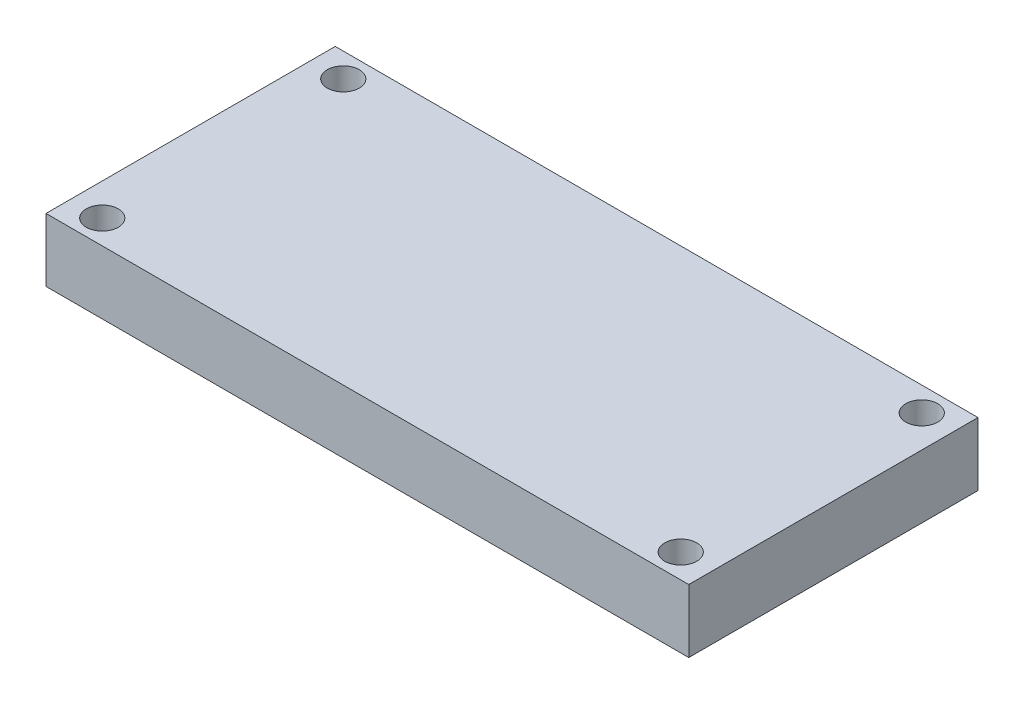
ISO-10303-21;
HEADER;
FILE_DESCRIPTION(('STEP AP214'),'2;1');
FILE_NAME('part.step','',(''),(''),'','','');
FILE_SCHEMA(('AUTOMOTIVE_DESIGN { 1 0 10303 214 1 1 1 1 }'));
ENDSEC;
DATA;
#1=APPLICATION_CONTEXT('core data for automotive mechanical design processes');
#2=APPLICATION_PROTOCOL_DEFINITION('international standard','automotive_design',2000,#1);
#3=PRODUCT_CONTEXT('',#1,'mechanical');
#4=PRODUCT('Part','Part','',(#3));
#5=PRODUCT_RELATED_PRODUCT_CATEGORY('part','',(#4));
#6=PRODUCT_DEFINITION_FORMATION('','',#4);
#7=PRODUCT_DEFINITION_CONTEXT('part definition',#1,'design');
#8=PRODUCT_DEFINITION('design','',#6,#7);
#9=PRODUCT_DEFINITION_SHAPE('','',#8);
#10=(LENGTH_UNIT() NAMED_UNIT(*) SI_UNIT(.MILLI.,.METRE.));
#11=(NAMED_UNIT(*) PLANE_ANGLE_UNIT() SI_UNIT($,.RADIAN.));
#12=(NAMED_UNIT(*) SI_UNIT($,.STERADIAN.) SOLID_ANGLE_UNIT());
#13=UNCERTAINTY_MEASURE_WITH_UNIT(LENGTH_MEASURE(1.E-05),#10,'distance_accuracy_value','');
#14=(GEOMETRIC_REPRESENTATION_CONTEXT(3) GLOBAL_UNCERTAINTY_ASSIGNED_CONTEXT((#13)) GLOBAL_UNIT_ASSIGNED_CONTEXT((#10,
#11,#12)) REPRESENTATION_CONTEXT('',''));
#15=CARTESIAN_POINT('',(0.,0.,0.));
#16=DIRECTION('',(0.,0.,1.));
#17=DIRECTION('',(1.,0.,0.));
#18=AXIS2_PLACEMENT_3D('',#15,#16,#17);
#19=CARTESIAN_POINT('',(25.4,5.,11.43));
#20=DIRECTION('',(-1.,0.,0.));
#21=DIRECTION('',(0.,0.,1.));
#22=AXIS2_PLACEMENT_3D('',#19,#20,#21);
#23=PLANE('',#22);
#24=DIRECTION('',(0.,0.,-1.));
#25=VECTOR('',#24,1.);
#26=CARTESIAN_POINT('',(25.4,0.,11.43));
#27=LINE('',#26,#25);
#28=CARTESIAN_POINT('',(25.4,0.,11.43));
#29=VERTEX_POINT('',#28);
#30=CARTESIAN_POINT('',(25.4,0.,-11.43));
#31=VERTEX_POINT('',#30);
#32=EDGE_CURVE('E96',#29,#31,#27,.T.);
#33=ORIENTED_EDGE('',*,*,#32,.T.);
#34=DIRECTION('',(0.,-1.,0.));
#35=VECTOR('',#34,1.);
#36=CARTESIAN_POINT('',(25.4,5.,-11.43));
#37=LINE('',#36,#35);
#38=CARTESIAN_POINT('',(25.4,5.,-11.43));
#39=VERTEX_POINT('',#38);
#40=EDGE_CURVE('E11',#39,#31,#37,.T.);
#41=ORIENTED_EDGE('',*,*,#40,.F.);
#42=DIRECTION('',(0.,0.,-1.));
#43=VECTOR('',#42,1.);
#44=CARTESIAN_POINT('',(25.4,5.,11.43));
#45=LINE('',#44,#43);
#46=CARTESIAN_POINT('',(25.4,5.,11.43));
#47=VERTEX_POINT('',#46);
#48=EDGE_CURVE('E84',#47,#39,#45,.T.);
#49=ORIENTED_EDGE('',*,*,#48,.F.);
#50=DIRECTION('',(0.,-1.,0.));
#51=VECTOR('',#50,1.);
#52=CARTESIAN_POINT('',(25.4,5.,11.43));
#53=LINE('',#52,#51);
#54=EDGE_CURVE('E92',#47,#29,#53,.T.);
#55=ORIENTED_EDGE('',*,*,#54,.T.);
#56=EDGE_LOOP('',(#33,#41,#49,#55));
#57=FACE_BOUND('',#56,.T.);
#58=ADVANCED_FACE('F33',(#57),#23,.F.);
#59=CARTESIAN_POINT('',(-25.4,5.,-11.43));
#60=DIRECTION('',(0.,0.,1.));
#61=DIRECTION('',(1.,0.,0.));
#62=AXIS2_PLACEMENT_3D('',#59,#60,#61);
#63=PLANE('',#62);
#64=DIRECTION('',(-1.,0.,0.));
#65=VECTOR('',#64,1.);
#66=CARTESIAN_POINT('',(-25.4,0.,-11.43));
#67=LINE('',#66,#65);
#68=CARTESIAN_POINT('',(-25.4,0.,-11.43));
#69=VERTEX_POINT('',#68);
#70=EDGE_CURVE('E88',#31,#69,#67,.T.);
#71=ORIENTED_EDGE('',*,*,#70,.T.);
#72=DIRECTION('',(0.,-1.,0.));
#73=VECTOR('',#72,1.);
#74=CARTESIAN_POINT('',(-25.4,5.,-11.43));
#75=LINE('',#74,#73);
#76=CARTESIAN_POINT('',(-25.4,5.,-11.43));
#77=VERTEX_POINT('',#76);
#78=EDGE_CURVE('E41',#77,#69,#75,.T.);
#79=ORIENTED_EDGE('',*,*,#78,.F.);
#80=DIRECTION('',(-1.,0.,0.));
#81=VECTOR('',#80,1.);
#82=CARTESIAN_POINT('',(-25.4,5.,-11.43));
#83=LINE('',#82,#81);
#84=EDGE_CURVE('E79',#39,#77,#83,.T.);
#85=ORIENTED_EDGE('',*,*,#84,.F.);
#86=ORIENTED_EDGE('',*,*,#40,.T.);
#87=EDGE_LOOP('',(#71,#79,#85,#86));
#88=FACE_BOUND('',#87,.T.);
#89=ADVANCED_FACE('F87',(#88),#63,.F.);
#90=CARTESIAN_POINT('',(-25.4,5.,11.43));
#91=DIRECTION('',(1.,0.,0.));
#92=DIRECTION('',(0.,0.,-1.));
#93=AXIS2_PLACEMENT_3D('',#90,#91,#92);
#94=PLANE('',#93);
#95=DIRECTION('',(0.,0.,1.));
#96=VECTOR('',#95,1.);
#97=CARTESIAN_POINT('',(-25.4,0.,11.43));
#98=LINE('',#97,#96);
#99=CARTESIAN_POINT('',(-25.4,0.,11.43));
#100=VERTEX_POINT('',#99);
#101=EDGE_CURVE('E66',#69,#100,#98,.T.);
#102=ORIENTED_EDGE('',*,*,#101,.T.);
#103=DIRECTION('',(0.,-1.,0.));
#104=VECTOR('',#103,1.);
#105=CARTESIAN_POINT('',(-25.4,5.,11.43));
#106=LINE('',#105,#104);
#107=CARTESIAN_POINT('',(-25.4,5.,11.43));
#108=VERTEX_POINT('',#107);
#109=EDGE_CURVE('E89',#108,#100,#106,.T.);
#110=ORIENTED_EDGE('',*,*,#109,.F.);
#111=DIRECTION('',(0.,0.,1.));
#112=VECTOR('',#111,1.);
#113=CARTESIAN_POINT('',(-25.4,5.,11.43));
#114=LINE('',#113,#112);
#115=EDGE_CURVE('E82',#77,#108,#114,.T.);
#116=ORIENTED_EDGE('',*,*,#115,.F.);
#117=ORIENTED_EDGE('',*,*,#78,.T.);
#118=EDGE_LOOP('',(#102,#110,#116,#117));
#119=FACE_BOUND('',#118,.T.);
#120=ADVANCED_FACE('F90',(#119),#94,.F.);
#121=CARTESIAN_POINT('',(-25.4,5.,11.43));
#122=DIRECTION('',(0.,0.,-1.));
#123=DIRECTION('',(-1.,0.,0.));
#124=AXIS2_PLACEMENT_3D('',#121,#122,#123);
#125=PLANE('',#124);
#126=DIRECTION('',(1.,0.,0.));
#127=VECTOR('',#126,1.);
#128=CARTESIAN_POINT('',(-25.4,0.,11.43));
#129=LINE('',#128,#127);
#130=EDGE_CURVE('E72',#100,#29,#129,.T.);
#131=ORIENTED_EDGE('',*,*,#130,.T.);
#132=ORIENTED_EDGE('',*,*,#54,.F.);
#133=DIRECTION('',(1.,0.,0.));
#134=VECTOR('',#133,1.);
#135=CARTESIAN_POINT('',(-25.4,5.,11.43));
#136=LINE('',#135,#134);
#137=EDGE_CURVE('E49',#108,#47,#136,.T.);
#138=ORIENTED_EDGE('',*,*,#137,.F.);
#139=ORIENTED_EDGE('',*,*,#109,.T.);
#140=EDGE_LOOP('',(#131,#132,#138,#139));
#141=FACE_BOUND('',#140,.T.);
#142=ADVANCED_FACE('F104',(#141),#125,.F.);
#143=CARTESIAN_POINT('',(0.,5.,0.));
#144=DIRECTION('',(0.,-1.,0.));
#145=DIRECTION('',(0.,0.,-1.));
#146=AXIS2_PLACEMENT_3D('',#143,#144,#145);
#147=PLANE('',#146);
#148=CARTESIAN_POINT('',(-22.86,5.,-9.525));
#149=DIRECTION('',(0.,1.,0.));
#150=DIRECTION('',(0.,0.,1.));
#151=AXIS2_PLACEMENT_3D('',#148,#149,#150);
#152=CIRCLE('',#151,1.26365);
#153=CARTESIAN_POINT('',(-22.86,5.,-8.26135));
#154=VERTEX_POINT('',#153);
#155=EDGE_CURVE('E130',#154,#154,#152,.T.);
#156=ORIENTED_EDGE('',*,*,#155,.F.);
#157=EDGE_LOOP('',(#156));
#158=FACE_BOUND('',#157,.T.);
#159=CARTESIAN_POINT('',(-22.86,5.,9.525));
#160=DIRECTION('',(0.,1.,0.));
#161=DIRECTION('',(0.,0.,1.));
#162=AXIS2_PLACEMENT_3D('',#159,#160,#161);
#163=CIRCLE('',#162,1.26365);
#164=CARTESIAN_POINT('',(-22.86,5.,10.78865));
#165=VERTEX_POINT('',#164);
#166=EDGE_CURVE('E124',#165,#165,#163,.T.);
#167=ORIENTED_EDGE('',*,*,#166,.F.);
#168=EDGE_LOOP('',(#167));
#169=FACE_BOUND('',#168,.T.);
#170=CARTESIAN_POINT('',(22.86,5.,-9.525));
#171=DIRECTION('',(0.,1.,0.));
#172=DIRECTION('',(0.,0.,1.));
#173=AXIS2_PLACEMENT_3D('',#170,#171,#172);
#174=CIRCLE('',#173,1.26365);
#175=CARTESIAN_POINT('',(22.86,5.,-8.26135));
#176=VERTEX_POINT('',#175);
#177=EDGE_CURVE('E118',#176,#176,#174,.T.);
#178=ORIENTED_EDGE('',*,*,#177,.F.);
#179=EDGE_LOOP('',(#178));
#180=FACE_BOUND('',#179,.T.);
#181=CARTESIAN_POINT('',(22.86,5.,9.525));
#182=DIRECTION('',(0.,1.,0.));
#183=DIRECTION('',(0.,0.,1.));
#184=AXIS2_PLACEMENT_3D('',#181,#182,#183);
#185=CIRCLE('',#184,1.26365);
#186=CARTESIAN_POINT('',(22.86,5.,10.78865));
#187=VERTEX_POINT('',#186);
#188=EDGE_CURVE('E112',#187,#187,#185,.T.);
#189=ORIENTED_EDGE('',*,*,#188,.F.);
#190=EDGE_LOOP('',(#189));
#191=FACE_BOUND('',#190,.T.);
#192=ORIENTED_EDGE('',*,*,#48,.T.);
#193=ORIENTED_EDGE('',*,*,#84,.T.);
#194=ORIENTED_EDGE('',*,*,#115,.T.);
#195=ORIENTED_EDGE('',*,*,#137,.T.);
#196=EDGE_LOOP('',(#192,#193,#194,#195));
#197=FACE_BOUND('',#196,.T.);
#198=ADVANCED_FACE('F80',(#158,#169,#180,#191,#197),#147,.F.);
#199=CARTESIAN_POINT('',(0.,0.,0.));
#200=DIRECTION('',(0.,-1.,0.));
#201=DIRECTION('',(0.,0.,-1.));
#202=AXIS2_PLACEMENT_3D('',#199,#200,#201);
#203=PLANE('',#202);
#204=CARTESIAN_POINT('',(-22.86,0.,-9.525));
#205=DIRECTION('',(0.,1.,0.));
#206=DIRECTION('',(0.,0.,1.));
#207=AXIS2_PLACEMENT_3D('',#204,#205,#206);
#208=CIRCLE('',#207,1.26365);
#209=CARTESIAN_POINT('',(-22.86,0.,-8.26135));
#210=VERTEX_POINT('',#209);
#211=EDGE_CURVE('E127',#210,#210,#208,.T.);
#212=ORIENTED_EDGE('',*,*,#211,.T.);
#213=EDGE_LOOP('',(#212));
#214=FACE_BOUND('',#213,.T.);
#215=CARTESIAN_POINT('',(-22.86,0.,9.525));
#216=DIRECTION('',(0.,1.,0.));
#217=DIRECTION('',(0.,0.,1.));
#218=AXIS2_PLACEMENT_3D('',#215,#216,#217);
#219=CIRCLE('',#218,1.26365);
#220=CARTESIAN_POINT('',(-22.86,0.,10.78865));
#221=VERTEX_POINT('',#220);
#222=EDGE_CURVE('E121',#221,#221,#219,.T.);
#223=ORIENTED_EDGE('',*,*,#222,.T.);
#224=EDGE_LOOP('',(#223));
#225=FACE_BOUND('',#224,.T.);
#226=CARTESIAN_POINT('',(22.86,0.,-9.525));
#227=DIRECTION('',(0.,1.,0.));
#228=DIRECTION('',(0.,0.,1.));
#229=AXIS2_PLACEMENT_3D('',#226,#227,#228);
#230=CIRCLE('',#229,1.26365);
#231=CARTESIAN_POINT('',(22.86,0.,-8.26135));
#232=VERTEX_POINT('',#231);
#233=EDGE_CURVE('E115',#232,#232,#230,.T.);
#234=ORIENTED_EDGE('',*,*,#233,.T.);
#235=EDGE_LOOP('',(#234));
#236=FACE_BOUND('',#235,.T.);
#237=CARTESIAN_POINT('',(22.86,0.,9.525));
#238=DIRECTION('',(0.,1.,0.));
#239=DIRECTION('',(0.,0.,1.));
#240=AXIS2_PLACEMENT_3D('',#237,#238,#239);
#241=CIRCLE('',#240,1.26365);
#242=CARTESIAN_POINT('',(22.86,0.,10.78865));
#243=VERTEX_POINT('',#242);
#244=EDGE_CURVE('E99',#243,#243,#241,.T.);
#245=ORIENTED_EDGE('',*,*,#244,.T.);
#246=EDGE_LOOP('',(#245));
#247=FACE_BOUND('',#246,.T.);
#248=ORIENTED_EDGE('',*,*,#32,.F.);
#249=ORIENTED_EDGE('',*,*,#130,.F.);
#250=ORIENTED_EDGE('',*,*,#101,.F.);
#251=ORIENTED_EDGE('',*,*,#70,.F.);
#252=EDGE_LOOP('',(#248,#249,#250,#251));
#253=FACE_BOUND('',#252,.T.);
#254=ADVANCED_FACE('F107',(#214,#225,#236,#247,#253),#203,.T.);
#255=CARTESIAN_POINT('',(22.86,5.,9.525));
#256=DIRECTION('',(0.,1.,0.));
#257=DIRECTION('',(0.,0.,1.));
#258=AXIS2_PLACEMENT_3D('',#255,#256,#257);
#259=CYLINDRICAL_SURFACE('',#258,1.26365);
#260=ORIENTED_EDGE('',*,*,#244,.F.);
#261=EDGE_LOOP('',(#260));
#262=FACE_BOUND('',#261,.T.);
#263=ORIENTED_EDGE('',*,*,#188,.T.);
#264=EDGE_LOOP('',(#263));
#265=FACE_BOUND('',#264,.T.);
#266=ADVANCED_FACE('F145',(#262,#265),#259,.F.);
#267=CARTESIAN_POINT('',(22.86,5.,-9.525));
#268=DIRECTION('',(0.,1.,0.));
#269=DIRECTION('',(0.,0.,1.));
#270=AXIS2_PLACEMENT_3D('',#267,#268,#269);
#271=CYLINDRICAL_SURFACE('',#270,1.26365);
#272=ORIENTED_EDGE('',*,*,#233,.F.);
#273=EDGE_LOOP('',(#272));
#274=FACE_BOUND('',#273,.T.);
#275=ORIENTED_EDGE('',*,*,#177,.T.);
#276=EDGE_LOOP('',(#275));
#277=FACE_BOUND('',#276,.T.);
#278=ADVANCED_FACE('F147',(#274,#277),#271,.F.);
#279=CARTESIAN_POINT('',(-22.86,5.,9.525));
#280=DIRECTION('',(0.,1.,0.));
#281=DIRECTION('',(0.,0.,1.));
#282=AXIS2_PLACEMENT_3D('',#279,#280,#281);
#283=CYLINDRICAL_SURFACE('',#282,1.26365);
#284=ORIENTED_EDGE('',*,*,#222,.F.);
#285=EDGE_LOOP('',(#284));
#286=FACE_BOUND('',#285,.T.);
#287=ORIENTED_EDGE('',*,*,#166,.T.);
#288=EDGE_LOOP('',(#287));
#289=FACE_BOUND('',#288,.T.);
#290=ADVANCED_FACE('F154',(#286,#289),#283,.F.);
#291=CARTESIAN_POINT('',(-22.86,5.,-9.525));
#292=DIRECTION('',(0.,1.,0.));
#293=DIRECTION('',(0.,0.,1.));
#294=AXIS2_PLACEMENT_3D('',#291,#292,#293);
#295=CYLINDRICAL_SURFACE('',#294,1.26365);
#296=ORIENTED_EDGE('',*,*,#211,.F.);
#297=EDGE_LOOP('',(#296));
#298=FACE_BOUND('',#297,.T.);
#299=ORIENTED_EDGE('',*,*,#155,.T.);
#300=EDGE_LOOP('',(#299));
#301=FACE_BOUND('',#300,.T.);
#302=ADVANCED_FACE('F134',(#298,#301),#295,.F.);
#303=CLOSED_SHELL('',(#58,#89,#120,#142,#198,#254,#266,#278,#290,#302));
#304=MANIFOLD_SOLID_BREP('B2',#303);
#305=ADVANCED_BREP_SHAPE_REPRESENTATION('',(#18,#304),#14);
#306=SHAPE_DEFINITION_REPRESENTATION(#9,#305);
ENDSEC;
END-ISO-10303-21;
